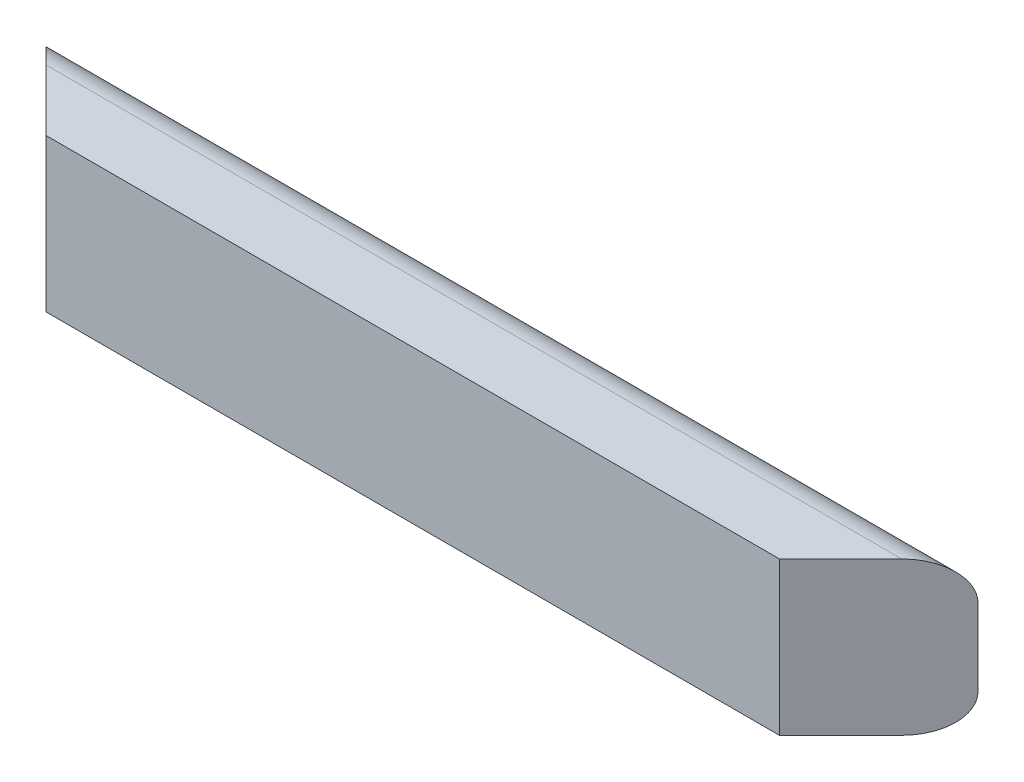
ISO-10303-21;
HEADER;
FILE_DESCRIPTION(('STEP AP214'),'2;1');
FILE_NAME('part.step','',(''),(''),'','','');
FILE_SCHEMA(('AUTOMOTIVE_DESIGN { 1 0 10303 214 1 1 1 1 }'));
ENDSEC;
DATA;
#1=APPLICATION_CONTEXT('core data for automotive mechanical design processes');
#2=APPLICATION_PROTOCOL_DEFINITION('international standard','automotive_design',2000,#1);
#3=PRODUCT_CONTEXT('',#1,'mechanical');
#4=PRODUCT('Part','Part','',(#3));
#5=PRODUCT_RELATED_PRODUCT_CATEGORY('part','',(#4));
#6=PRODUCT_DEFINITION_FORMATION('','',#4);
#7=PRODUCT_DEFINITION_CONTEXT('part definition',#1,'design');
#8=PRODUCT_DEFINITION('design','',#6,#7);
#9=PRODUCT_DEFINITION_SHAPE('','',#8);
#10=(LENGTH_UNIT() NAMED_UNIT(*) SI_UNIT(.MILLI.,.METRE.));
#11=(NAMED_UNIT(*) PLANE_ANGLE_UNIT() SI_UNIT($,.RADIAN.));
#12=(NAMED_UNIT(*) SI_UNIT($,.STERADIAN.) SOLID_ANGLE_UNIT());
#13=UNCERTAINTY_MEASURE_WITH_UNIT(LENGTH_MEASURE(1.E-05),#10,'distance_accuracy_value','');
#14=(GEOMETRIC_REPRESENTATION_CONTEXT(3) GLOBAL_UNCERTAINTY_ASSIGNED_CONTEXT((#13)) GLOBAL_UNIT_ASSIGNED_CONTEXT((#10,
#11,#12)) REPRESENTATION_CONTEXT('',''));
#15=CARTESIAN_POINT('',(0.,0.,0.));
#16=DIRECTION('',(0.,0.,1.));
#17=DIRECTION('',(1.,0.,0.));
#18=AXIS2_PLACEMENT_3D('',#15,#16,#17);
#19=CARTESIAN_POINT('',(774.7,0.,0.));
#20=DIRECTION('',(0.,1.,0.));
#21=DIRECTION('',(0.,0.,1.));
#22=AXIS2_PLACEMENT_3D('',#19,#20,#21);
#23=PLANE('',#22);
#24=DIRECTION('',(-1.,0.,0.));
#25=VECTOR('',#24,1.);
#26=CARTESIAN_POINT('',(774.7,0.,19.05));
#27=LINE('',#26,#25);
#28=CARTESIAN_POINT('',(692.15,0.,19.05));
#29=VERTEX_POINT('',#28);
#30=CARTESIAN_POINT('',(82.5500000000001,0.,19.05));
#31=VERTEX_POINT('',#30);
#32=EDGE_CURVE('E133',#29,#31,#27,.T.);
#33=ORIENTED_EDGE('',*,*,#32,.T.);
#34=DIRECTION('',(-0.707106781186549,0.,-0.707106781186546));
#35=VECTOR('',#34,1.);
#36=CARTESIAN_POINT('',(419.100000000001,0.,355.6));
#37=LINE('',#36,#35);
#38=CARTESIAN_POINT('',(31.7499999999998,0.,-31.7499999999999));
#39=VERTEX_POINT('',#38);
#40=EDGE_CURVE('E116',#31,#39,#37,.T.);
#41=ORIENTED_EDGE('',*,*,#40,.T.);
#42=DIRECTION('',(-1.,0.,0.));
#43=VECTOR('',#42,1.);
#44=CARTESIAN_POINT('',(774.7,0.,-31.75));
#45=LINE('',#44,#43);
#46=CARTESIAN_POINT('',(742.95,0.,-31.75));
#47=VERTEX_POINT('',#46);
#48=EDGE_CURVE('E11',#47,#39,#45,.T.);
#49=ORIENTED_EDGE('',*,*,#48,.F.);
#50=DIRECTION('',(-0.707106781186549,0.,0.707106781186546));
#51=VECTOR('',#50,1.);
#52=CARTESIAN_POINT('',(742.95,0.,-31.75));
#53=LINE('',#52,#51);
#54=EDGE_CURVE('E141',#47,#29,#53,.T.);
#55=ORIENTED_EDGE('',*,*,#54,.T.);
#56=EDGE_LOOP('',(#33,#41,#49,#55));
#57=FACE_BOUND('',#56,.T.);
#58=ADVANCED_FACE('F38',(#57),#23,.F.);
#59=CARTESIAN_POINT('',(774.7,31.75,-31.75));
#60=DIRECTION('',(-1.,0.,0.));
#61=DIRECTION('',(0.,0.,1.));
#62=AXIS2_PLACEMENT_3D('',#59,#60,#61);
#63=CYLINDRICAL_SURFACE('',#62,31.75);
#64=ORIENTED_EDGE('',*,*,#48,.T.);
#65=CARTESIAN_POINT('',(31.7499999999997,31.75,-31.75));
#66=DIRECTION('',(0.707106781186546,0.,-0.707106781186549));
#67=DIRECTION('',(-0.707106781186549,0.,-0.707106781186546));
#68=AXIS2_PLACEMENT_3D('',#65,#66,#67);
#69=ELLIPSE('',#68,44.9012806053458,31.75);
#70=CARTESIAN_POINT('',(0.,31.75,-63.4999999999998));
#71=VERTEX_POINT('',#70);
#72=EDGE_CURVE('E99',#39,#71,#69,.T.);
#73=ORIENTED_EDGE('',*,*,#72,.T.);
#74=DIRECTION('',(-1.,0.,0.));
#75=VECTOR('',#74,1.);
#76=CARTESIAN_POINT('',(774.7,31.75,-63.5));
#77=LINE('',#76,#75);
#78=CARTESIAN_POINT('',(774.7,31.75,-63.5));
#79=VERTEX_POINT('',#78);
#80=EDGE_CURVE('E47',#79,#71,#77,.T.);
#81=ORIENTED_EDGE('',*,*,#80,.F.);
#82=CARTESIAN_POINT('',(742.95,31.75,-31.75));
#83=DIRECTION('',(-0.707106781186546,0.,-0.707106781186549));
#84=DIRECTION('',(-0.707106781186549,0.,0.707106781186546));
#85=AXIS2_PLACEMENT_3D('',#82,#83,#84);
#86=ELLIPSE('',#85,44.9012806053458,31.75);
#87=EDGE_CURVE('E56',#79,#47,#86,.T.);
#88=ORIENTED_EDGE('',*,*,#87,.T.);
#89=EDGE_LOOP('',(#64,#73,#81,#88));
#90=FACE_BOUND('',#89,.T.);
#91=ADVANCED_FACE('F111',(#90),#63,.T.);
#92=CARTESIAN_POINT('',(774.7,95.25,-63.5));
#93=DIRECTION('',(0.,0.,1.));
#94=DIRECTION('',(1.,0.,0.));
#95=AXIS2_PLACEMENT_3D('',#92,#93,#94);
#96=PLANE('',#95);
#97=DIRECTION('',(0.,1.,0.));
#98=VECTOR('',#97,1.);
#99=CARTESIAN_POINT('',(0.,95.25,-63.5));
#100=LINE('',#99,#98);
#101=CARTESIAN_POINT('',(0.,95.25,-63.5));
#102=VERTEX_POINT('',#101);
#103=EDGE_CURVE('E96',#71,#102,#100,.T.);
#104=ORIENTED_EDGE('',*,*,#103,.T.);
#105=DIRECTION('',(-1.,0.,0.));
#106=VECTOR('',#105,1.);
#107=CARTESIAN_POINT('',(774.7,95.25,-63.5));
#108=LINE('',#107,#106);
#109=CARTESIAN_POINT('',(774.7,95.25,-63.4999999999998));
#110=VERTEX_POINT('',#109);
#111=EDGE_CURVE('E120',#110,#102,#108,.T.);
#112=ORIENTED_EDGE('',*,*,#111,.F.);
#113=DIRECTION('',(0.,1.,0.));
#114=VECTOR('',#113,1.);
#115=CARTESIAN_POINT('',(774.7,95.25,-63.5));
#116=LINE('',#115,#114);
#117=EDGE_CURVE('E108',#79,#110,#116,.T.);
#118=ORIENTED_EDGE('',*,*,#117,.F.);
#119=ORIENTED_EDGE('',*,*,#80,.T.);
#120=EDGE_LOOP('',(#104,#112,#118,#119));
#121=FACE_BOUND('',#120,.T.);
#122=ADVANCED_FACE('F118',(#121),#96,.F.);
#123=CARTESIAN_POINT('',(774.7,95.25,-31.75));
#124=DIRECTION('',(-1.,0.,0.));
#125=DIRECTION('',(0.,0.,1.));
#126=AXIS2_PLACEMENT_3D('',#123,#124,#125);
#127=CYLINDRICAL_SURFACE('',#126,31.75);
#128=ORIENTED_EDGE('',*,*,#111,.T.);
#129=CARTESIAN_POINT('',(31.7499999999997,95.25,-31.75));
#130=DIRECTION('',(0.707106781186546,0.,-0.707106781186549));
#131=DIRECTION('',(-0.707106781186549,0.,-0.707106781186546));
#132=AXIS2_PLACEMENT_3D('',#129,#130,#131);
#133=ELLIPSE('',#132,44.9012806053458,31.75);
#134=CARTESIAN_POINT('',(31.7499999999997,127.,-31.75));
#135=VERTEX_POINT('',#134);
#136=EDGE_CURVE('E102',#102,#135,#133,.T.);
#137=ORIENTED_EDGE('',*,*,#136,.T.);
#138=DIRECTION('',(-1.,0.,0.));
#139=VECTOR('',#138,1.);
#140=CARTESIAN_POINT('',(774.7,127.,-31.75));
#141=LINE('',#140,#139);
#142=CARTESIAN_POINT('',(742.95,127.,-31.75));
#143=VERTEX_POINT('',#142);
#144=EDGE_CURVE('E123',#143,#135,#141,.T.);
#145=ORIENTED_EDGE('',*,*,#144,.F.);
#146=CARTESIAN_POINT('',(742.95,95.25,-31.75));
#147=DIRECTION('',(-0.707106781186546,0.,-0.707106781186549));
#148=DIRECTION('',(-0.707106781186549,0.,0.707106781186546));
#149=AXIS2_PLACEMENT_3D('',#146,#147,#148);
#150=ELLIPSE('',#149,44.9012806053458,31.75);
#151=EDGE_CURVE('E115',#143,#110,#150,.T.);
#152=ORIENTED_EDGE('',*,*,#151,.T.);
#153=EDGE_LOOP('',(#128,#137,#145,#152));
#154=FACE_BOUND('',#153,.T.);
#155=ADVANCED_FACE('F167',(#154),#127,.T.);
#156=CARTESIAN_POINT('',(774.7,127.,19.05));
#157=DIRECTION('',(0.,-1.,0.));
#158=DIRECTION('',(0.,0.,-1.));
#159=AXIS2_PLACEMENT_3D('',#156,#157,#158);
#160=PLANE('',#159);
#161=ORIENTED_EDGE('',*,*,#144,.T.);
#162=DIRECTION('',(0.707106781186549,0.,0.707106781186546));
#163=VECTOR('',#162,1.);
#164=CARTESIAN_POINT('',(428.625000000001,127.,365.125));
#165=LINE('',#164,#163);
#166=CARTESIAN_POINT('',(82.55,127.,19.05));
#167=VERTEX_POINT('',#166);
#168=EDGE_CURVE('E161',#135,#167,#165,.T.);
#169=ORIENTED_EDGE('',*,*,#168,.T.);
#170=DIRECTION('',(-1.,0.,0.));
#171=VECTOR('',#170,1.);
#172=CARTESIAN_POINT('',(774.7,127.,19.05));
#173=LINE('',#172,#171);
#174=CARTESIAN_POINT('',(692.15,127.,19.05));
#175=VERTEX_POINT('',#174);
#176=EDGE_CURVE('E129',#175,#167,#173,.T.);
#177=ORIENTED_EDGE('',*,*,#176,.F.);
#178=DIRECTION('',(0.707106781186549,0.,-0.707106781186546));
#179=VECTOR('',#178,1.);
#180=CARTESIAN_POINT('',(733.425,127.,-22.2250000000001));
#181=LINE('',#180,#179);
#182=EDGE_CURVE('E149',#175,#143,#181,.T.);
#183=ORIENTED_EDGE('',*,*,#182,.T.);
#184=EDGE_LOOP('',(#161,#169,#177,#183));
#185=FACE_BOUND('',#184,.T.);
#186=ADVANCED_FACE('F169',(#185),#160,.F.);
#187=CARTESIAN_POINT('',(774.7,0.,19.05));
#188=DIRECTION('',(0.,0.,-1.));
#189=DIRECTION('',(-1.,0.,0.));
#190=AXIS2_PLACEMENT_3D('',#187,#188,#189);
#191=PLANE('',#190);
#192=ORIENTED_EDGE('',*,*,#176,.T.);
#193=DIRECTION('',(0.,-1.,0.));
#194=VECTOR('',#193,1.);
#195=CARTESIAN_POINT('',(82.5500000000001,0.,19.05));
#196=LINE('',#195,#194);
#197=EDGE_CURVE('E157',#167,#31,#196,.T.);
#198=ORIENTED_EDGE('',*,*,#197,.T.);
#199=ORIENTED_EDGE('',*,*,#32,.F.);
#200=DIRECTION('',(0.,1.,0.));
#201=VECTOR('',#200,1.);
#202=CARTESIAN_POINT('',(692.15,0.,19.05));
#203=LINE('',#202,#201);
#204=EDGE_CURVE('E145',#29,#175,#203,.T.);
#205=ORIENTED_EDGE('',*,*,#204,.T.);
#206=EDGE_LOOP('',(#192,#198,#199,#205));
#207=FACE_BOUND('',#206,.T.);
#208=ADVANCED_FACE('F174',(#207),#191,.F.);
#209=CARTESIAN_POINT('',(355.599999999999,0.,355.6));
#210=DIRECTION('',(-0.707106781186546,0.,-0.707106781186549));
#211=DIRECTION('',(-0.707106781186549,0.,0.707106781186546));
#212=AXIS2_PLACEMENT_3D('',#209,#210,#211);
#213=PLANE('',#212);
#214=ORIENTED_EDGE('',*,*,#117,.T.);
#215=ORIENTED_EDGE('',*,*,#151,.F.);
#216=ORIENTED_EDGE('',*,*,#182,.F.);
#217=ORIENTED_EDGE('',*,*,#204,.F.);
#218=ORIENTED_EDGE('',*,*,#54,.F.);
#219=ORIENTED_EDGE('',*,*,#87,.F.);
#220=EDGE_LOOP('',(#214,#215,#216,#217,#218,#219));
#221=FACE_BOUND('',#220,.T.);
#222=ADVANCED_FACE('F171',(#221),#213,.F.);
#223=CARTESIAN_POINT('',(419.100000000001,0.,355.6));
#224=DIRECTION('',(0.707106781186546,0.,-0.707106781186549));
#225=DIRECTION('',(0.707106781186549,0.,0.707106781186546));
#226=AXIS2_PLACEMENT_3D('',#223,#224,#225);
#227=PLANE('',#226);
#228=ORIENTED_EDGE('',*,*,#40,.F.);
#229=ORIENTED_EDGE('',*,*,#197,.F.);
#230=ORIENTED_EDGE('',*,*,#168,.F.);
#231=ORIENTED_EDGE('',*,*,#136,.F.);
#232=ORIENTED_EDGE('',*,*,#103,.F.);
#233=ORIENTED_EDGE('',*,*,#72,.F.);
#234=EDGE_LOOP('',(#228,#229,#230,#231,#232,#233));
#235=FACE_BOUND('',#234,.T.);
#236=ADVANCED_FACE('F98',(#235),#227,.F.);
#237=CLOSED_SHELL('',(#58,#91,#122,#155,#186,#208,#222,#236));
#238=MANIFOLD_SOLID_BREP('B2',#237);
#239=ADVANCED_BREP_SHAPE_REPRESENTATION('',(#18,#238),#14);
#240=SHAPE_DEFINITION_REPRESENTATION(#9,#239);
ENDSEC;
END-ISO-10303-21;
